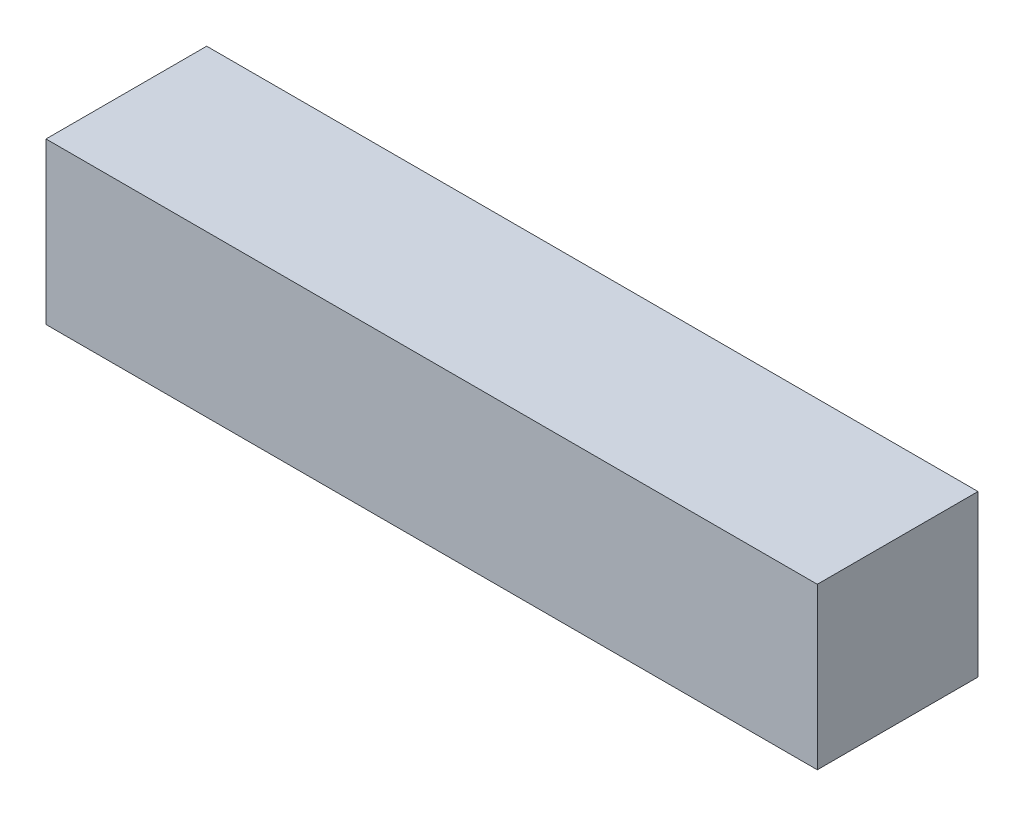
ISO-10303-21;
HEADER;
FILE_DESCRIPTION(('STEP AP214'),'2;1');
FILE_NAME('part.step','',(''),(''),'','','');
FILE_SCHEMA(('AUTOMOTIVE_DESIGN { 1 0 10303 214 1 1 1 1 }'));
ENDSEC;
DATA;
#1=APPLICATION_CONTEXT('core data for automotive mechanical design processes');
#2=APPLICATION_PROTOCOL_DEFINITION('international standard','automotive_design',2000,#1);
#3=PRODUCT_CONTEXT('',#1,'mechanical');
#4=PRODUCT('Part','Part','',(#3));
#5=PRODUCT_RELATED_PRODUCT_CATEGORY('part','',(#4));
#6=PRODUCT_DEFINITION_FORMATION('','',#4);
#7=PRODUCT_DEFINITION_CONTEXT('part definition',#1,'design');
#8=PRODUCT_DEFINITION('design','',#6,#7);
#9=PRODUCT_DEFINITION_SHAPE('','',#8);
#10=(LENGTH_UNIT() NAMED_UNIT(*) SI_UNIT(.MILLI.,.METRE.));
#11=(NAMED_UNIT(*) PLANE_ANGLE_UNIT() SI_UNIT($,.RADIAN.));
#12=(NAMED_UNIT(*) SI_UNIT($,.STERADIAN.) SOLID_ANGLE_UNIT());
#13=UNCERTAINTY_MEASURE_WITH_UNIT(LENGTH_MEASURE(1.E-05),#10,'distance_accuracy_value','');
#14=(GEOMETRIC_REPRESENTATION_CONTEXT(3) GLOBAL_UNCERTAINTY_ASSIGNED_CONTEXT((#13)) GLOBAL_UNIT_ASSIGNED_CONTEXT((#10,
#11,#12)) REPRESENTATION_CONTEXT('',''));
#15=CARTESIAN_POINT('',(0.,0.,0.));
#16=DIRECTION('',(0.,0.,1.));
#17=DIRECTION('',(1.,0.,0.));
#18=AXIS2_PLACEMENT_3D('',#15,#16,#17);
#19=CARTESIAN_POINT('',(-600.,0.,125.));
#20=DIRECTION('',(1.,0.,0.));
#21=DIRECTION('',(0.,0.,-1.));
#22=AXIS2_PLACEMENT_3D('',#19,#20,#21);
#23=PLANE('',#22);
#24=DIRECTION('',(0.,-1.,0.));
#25=VECTOR('',#24,1.);
#26=CARTESIAN_POINT('',(-600.,0.,-125.));
#27=LINE('',#26,#25);
#28=CARTESIAN_POINT('',(-600.,250.,-125.));
#29=VERTEX_POINT('',#28);
#30=CARTESIAN_POINT('',(-600.,0.,-125.));
#31=VERTEX_POINT('',#30);
#32=EDGE_CURVE('E98',#29,#31,#27,.T.);
#33=ORIENTED_EDGE('',*,*,#32,.T.);
#34=DIRECTION('',(0.,0.,-1.));
#35=VECTOR('',#34,1.);
#36=CARTESIAN_POINT('',(-600.,0.,125.));
#37=LINE('',#36,#35);
#38=CARTESIAN_POINT('',(-600.,0.,125.));
#39=VERTEX_POINT('',#38);
#40=EDGE_CURVE('E11',#39,#31,#37,.T.);
#41=ORIENTED_EDGE('',*,*,#40,.F.);
#42=DIRECTION('',(0.,-1.,0.));
#43=VECTOR('',#42,1.);
#44=CARTESIAN_POINT('',(-600.,0.,125.));
#45=LINE('',#44,#43);
#46=CARTESIAN_POINT('',(-600.,250.,125.));
#47=VERTEX_POINT('',#46);
#48=EDGE_CURVE('E86',#47,#39,#45,.T.);
#49=ORIENTED_EDGE('',*,*,#48,.F.);
#50=DIRECTION('',(0.,0.,-1.));
#51=VECTOR('',#50,1.);
#52=CARTESIAN_POINT('',(-600.,250.,125.));
#53=LINE('',#52,#51);
#54=EDGE_CURVE('E94',#47,#29,#53,.T.);
#55=ORIENTED_EDGE('',*,*,#54,.T.);
#56=EDGE_LOOP('',(#33,#41,#49,#55));
#57=FACE_BOUND('',#56,.T.);
#58=ADVANCED_FACE('F35',(#57),#23,.F.);
#59=CARTESIAN_POINT('',(-600.,0.,125.));
#60=DIRECTION('',(0.,1.,0.));
#61=DIRECTION('',(0.,0.,1.));
#62=AXIS2_PLACEMENT_3D('',#59,#60,#61);
#63=PLANE('',#62);
#64=DIRECTION('',(1.,0.,0.));
#65=VECTOR('',#64,1.);
#66=CARTESIAN_POINT('',(-600.,0.,-125.));
#67=LINE('',#66,#65);
#68=CARTESIAN_POINT('',(600.,0.,-125.));
#69=VERTEX_POINT('',#68);
#70=EDGE_CURVE('E90',#31,#69,#67,.T.);
#71=ORIENTED_EDGE('',*,*,#70,.T.);
#72=DIRECTION('',(0.,0.,-1.));
#73=VECTOR('',#72,1.);
#74=CARTESIAN_POINT('',(600.,0.,125.));
#75=LINE('',#74,#73);
#76=CARTESIAN_POINT('',(600.,0.,125.));
#77=VERTEX_POINT('',#76);
#78=EDGE_CURVE('E43',#77,#69,#75,.T.);
#79=ORIENTED_EDGE('',*,*,#78,.F.);
#80=DIRECTION('',(1.,0.,0.));
#81=VECTOR('',#80,1.);
#82=CARTESIAN_POINT('',(-600.,0.,125.));
#83=LINE('',#82,#81);
#84=EDGE_CURVE('E81',#39,#77,#83,.T.);
#85=ORIENTED_EDGE('',*,*,#84,.F.);
#86=ORIENTED_EDGE('',*,*,#40,.T.);
#87=EDGE_LOOP('',(#71,#79,#85,#86));
#88=FACE_BOUND('',#87,.T.);
#89=ADVANCED_FACE('F89',(#88),#63,.F.);
#90=CARTESIAN_POINT('',(600.,0.,125.));
#91=DIRECTION('',(-1.,0.,0.));
#92=DIRECTION('',(0.,0.,1.));
#93=AXIS2_PLACEMENT_3D('',#90,#91,#92);
#94=PLANE('',#93);
#95=DIRECTION('',(0.,1.,0.));
#96=VECTOR('',#95,1.);
#97=CARTESIAN_POINT('',(600.,0.,-125.));
#98=LINE('',#97,#96);
#99=CARTESIAN_POINT('',(600.,250.,-125.));
#100=VERTEX_POINT('',#99);
#101=EDGE_CURVE('E68',#69,#100,#98,.T.);
#102=ORIENTED_EDGE('',*,*,#101,.T.);
#103=DIRECTION('',(0.,0.,-1.));
#104=VECTOR('',#103,1.);
#105=CARTESIAN_POINT('',(600.,250.,125.));
#106=LINE('',#105,#104);
#107=CARTESIAN_POINT('',(600.,250.,125.));
#108=VERTEX_POINT('',#107);
#109=EDGE_CURVE('E91',#108,#100,#106,.T.);
#110=ORIENTED_EDGE('',*,*,#109,.F.);
#111=DIRECTION('',(0.,1.,0.));
#112=VECTOR('',#111,1.);
#113=CARTESIAN_POINT('',(600.,0.,125.));
#114=LINE('',#113,#112);
#115=EDGE_CURVE('E84',#77,#108,#114,.T.);
#116=ORIENTED_EDGE('',*,*,#115,.F.);
#117=ORIENTED_EDGE('',*,*,#78,.T.);
#118=EDGE_LOOP('',(#102,#110,#116,#117));
#119=FACE_BOUND('',#118,.T.);
#120=ADVANCED_FACE('F92',(#119),#94,.F.);
#121=CARTESIAN_POINT('',(-600.,250.,125.));
#122=DIRECTION('',(0.,-1.,0.));
#123=DIRECTION('',(0.,0.,-1.));
#124=AXIS2_PLACEMENT_3D('',#121,#122,#123);
#125=PLANE('',#124);
#126=DIRECTION('',(-1.,0.,0.));
#127=VECTOR('',#126,1.);
#128=CARTESIAN_POINT('',(-600.,250.,-125.));
#129=LINE('',#128,#127);
#130=EDGE_CURVE('E74',#100,#29,#129,.T.);
#131=ORIENTED_EDGE('',*,*,#130,.T.);
#132=ORIENTED_EDGE('',*,*,#54,.F.);
#133=DIRECTION('',(-1.,0.,0.));
#134=VECTOR('',#133,1.);
#135=CARTESIAN_POINT('',(-600.,250.,125.));
#136=LINE('',#135,#134);
#137=EDGE_CURVE('E51',#108,#47,#136,.T.);
#138=ORIENTED_EDGE('',*,*,#137,.F.);
#139=ORIENTED_EDGE('',*,*,#109,.T.);
#140=EDGE_LOOP('',(#131,#132,#138,#139));
#141=FACE_BOUND('',#140,.T.);
#142=ADVANCED_FACE('F105',(#141),#125,.F.);
#143=CARTESIAN_POINT('',(0.,0.,125.));
#144=DIRECTION('',(0.,0.,-1.));
#145=DIRECTION('',(-1.,0.,0.));
#146=AXIS2_PLACEMENT_3D('',#143,#144,#145);
#147=PLANE('',#146);
#148=ORIENTED_EDGE('',*,*,#48,.T.);
#149=ORIENTED_EDGE('',*,*,#84,.T.);
#150=ORIENTED_EDGE('',*,*,#115,.T.);
#151=ORIENTED_EDGE('',*,*,#137,.T.);
#152=EDGE_LOOP('',(#148,#149,#150,#151));
#153=FACE_BOUND('',#152,.T.);
#154=ADVANCED_FACE('F82',(#153),#147,.F.);
#155=CARTESIAN_POINT('',(0.,0.,-125.));
#156=DIRECTION('',(0.,0.,-1.));
#157=DIRECTION('',(-1.,0.,0.));
#158=AXIS2_PLACEMENT_3D('',#155,#156,#157);
#159=PLANE('',#158);
#160=ORIENTED_EDGE('',*,*,#32,.F.);
#161=ORIENTED_EDGE('',*,*,#130,.F.);
#162=ORIENTED_EDGE('',*,*,#101,.F.);
#163=ORIENTED_EDGE('',*,*,#70,.F.);
#164=EDGE_LOOP('',(#160,#161,#162,#163));
#165=FACE_BOUND('',#164,.T.);
#166=ADVANCED_FACE('F108',(#165),#159,.T.);
#167=CLOSED_SHELL('',(#58,#89,#120,#142,#154,#166));
#168=MANIFOLD_SOLID_BREP('B2',#167);
#169=ADVANCED_BREP_SHAPE_REPRESENTATION('',(#18,#168),#14);
#170=SHAPE_DEFINITION_REPRESENTATION(#9,#169);
ENDSEC;
END-ISO-10303-21;
